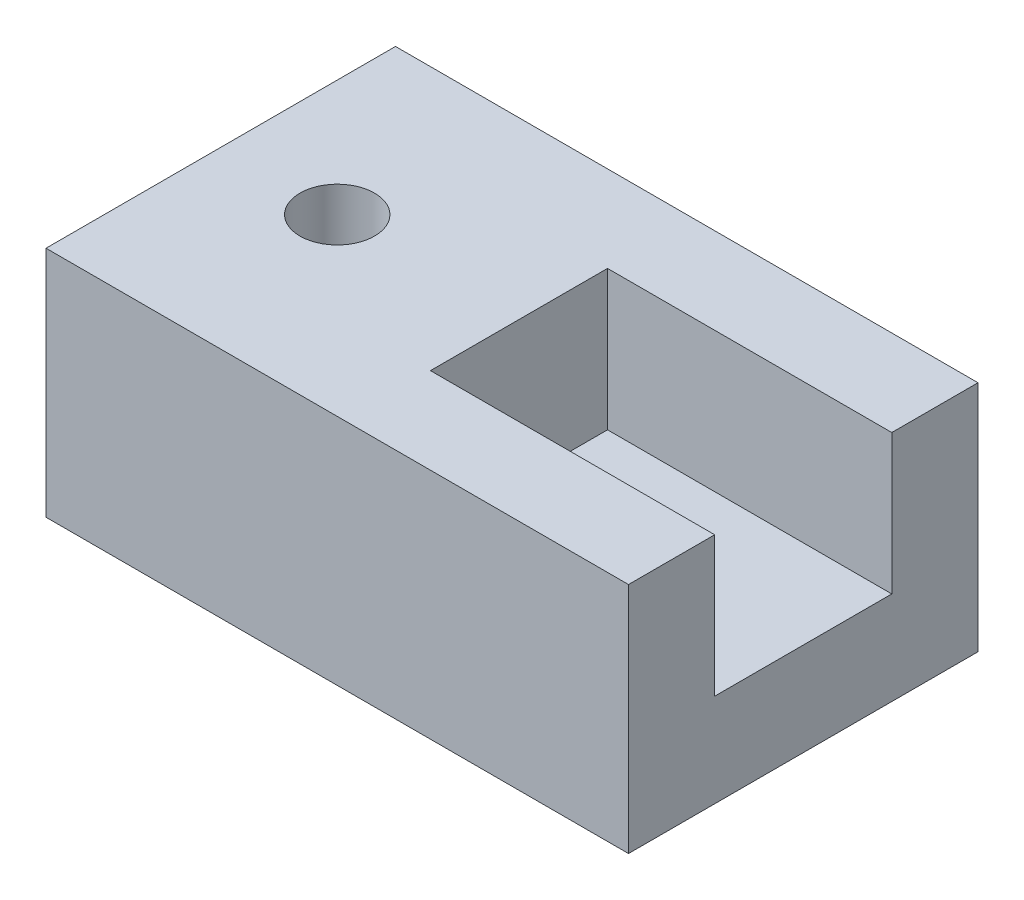
ISO-10303-21;
HEADER;
FILE_DESCRIPTION(('STEP AP214'),'2;1');
FILE_NAME('part.step','',(''),(''),'','','');
FILE_SCHEMA(('AUTOMOTIVE_DESIGN { 1 0 10303 214 1 1 1 1 }'));
ENDSEC;
DATA;
#1=APPLICATION_CONTEXT('core data for automotive mechanical design processes');
#2=APPLICATION_PROTOCOL_DEFINITION('international standard','automotive_design',2000,#1);
#3=PRODUCT_CONTEXT('',#1,'mechanical');
#4=PRODUCT('Part','Part','',(#3));
#5=PRODUCT_RELATED_PRODUCT_CATEGORY('part','',(#4));
#6=PRODUCT_DEFINITION_FORMATION('','',#4);
#7=PRODUCT_DEFINITION_CONTEXT('part definition',#1,'design');
#8=PRODUCT_DEFINITION('design','',#6,#7);
#9=PRODUCT_DEFINITION_SHAPE('','',#8);
#10=(LENGTH_UNIT() NAMED_UNIT(*) SI_UNIT(.MILLI.,.METRE.));
#11=(NAMED_UNIT(*) PLANE_ANGLE_UNIT() SI_UNIT($,.RADIAN.));
#12=(NAMED_UNIT(*) SI_UNIT($,.STERADIAN.) SOLID_ANGLE_UNIT());
#13=UNCERTAINTY_MEASURE_WITH_UNIT(LENGTH_MEASURE(1.E-05),#10,'distance_accuracy_value','');
#14=(GEOMETRIC_REPRESENTATION_CONTEXT(3) GLOBAL_UNCERTAINTY_ASSIGNED_CONTEXT((#13)) GLOBAL_UNIT_ASSIGNED_CONTEXT((#10,
#11,#12)) REPRESENTATION_CONTEXT('',''));
#15=CARTESIAN_POINT('',(0.,0.,0.));
#16=DIRECTION('',(0.,0.,1.));
#17=DIRECTION('',(1.,0.,0.));
#18=AXIS2_PLACEMENT_3D('',#15,#16,#17);
#19=CARTESIAN_POINT('',(25.,8.,-7.59999999999999));
#20=DIRECTION('',(0.,0.,-1.));
#21=DIRECTION('',(-1.,0.,0.));
#22=AXIS2_PLACEMENT_3D('',#19,#20,#21);
#23=PLANE('',#22);
#24=DIRECTION('',(0.,-1.,0.));
#25=VECTOR('',#24,1.);
#26=CARTESIAN_POINT('',(0.599999999999998,49.7724705054854,-7.60000000000002));
#27=LINE('',#26,#25);
#28=CARTESIAN_POINT('',(0.6,20.,-7.59999999999999));
#29=VERTEX_POINT('',#28);
#30=CARTESIAN_POINT('',(0.600000000000003,8.,-7.59999999999999));
#31=VERTEX_POINT('',#30);
#32=EDGE_CURVE('E109',#29,#31,#27,.T.);
#33=ORIENTED_EDGE('',*,*,#32,.T.);
#34=DIRECTION('',(-1.,0.,0.));
#35=VECTOR('',#34,1.);
#36=CARTESIAN_POINT('',(25.,8.,-7.59999999999999));
#37=LINE('',#36,#35);
#38=CARTESIAN_POINT('',(25.,8.,-7.59999999999999));
#39=VERTEX_POINT('',#38);
#40=EDGE_CURVE('E105',#39,#31,#37,.T.);
#41=ORIENTED_EDGE('',*,*,#40,.F.);
#42=DIRECTION('',(0.,-1.,0.));
#43=VECTOR('',#42,1.);
#44=CARTESIAN_POINT('',(25.,8.,-7.59999999999999));
#45=LINE('',#44,#43);
#46=CARTESIAN_POINT('',(25.,20.,-7.59999999999999));
#47=VERTEX_POINT('',#46);
#48=EDGE_CURVE('E108',#47,#39,#45,.T.);
#49=ORIENTED_EDGE('',*,*,#48,.F.);
#50=DIRECTION('',(-1.,0.,0.));
#51=VECTOR('',#50,1.);
#52=CARTESIAN_POINT('',(25.,20.,-7.59999999999999));
#53=LINE('',#52,#51);
#54=EDGE_CURVE('E56',#47,#29,#53,.T.);
#55=ORIENTED_EDGE('',*,*,#54,.T.);
#56=EDGE_LOOP('',(#33,#41,#49,#55));
#57=FACE_BOUND('',#56,.T.);
#58=ADVANCED_FACE('F41',(#57),#23,.F.);
#59=CARTESIAN_POINT('',(25.,8.,7.60000000000001));
#60=DIRECTION('',(0.,0.,1.));
#61=DIRECTION('',(0.,-1.,0.));
#62=AXIS2_PLACEMENT_3D('',#59,#60,#61);
#63=PLANE('',#62);
#64=DIRECTION('',(0.,-1.,0.));
#65=VECTOR('',#64,1.);
#66=CARTESIAN_POINT('',(0.6,49.7724705054855,7.6));
#67=LINE('',#66,#65);
#68=CARTESIAN_POINT('',(0.6,20.,7.60000000000001));
#69=VERTEX_POINT('',#68);
#70=CARTESIAN_POINT('',(0.6,8.,7.60000000000001));
#71=VERTEX_POINT('',#70);
#72=EDGE_CURVE('E64',#69,#71,#67,.T.);
#73=ORIENTED_EDGE('',*,*,#72,.F.);
#74=DIRECTION('',(-1.,0.,0.));
#75=VECTOR('',#74,1.);
#76=CARTESIAN_POINT('',(25.,20.,7.60000000000001));
#77=LINE('',#76,#75);
#78=CARTESIAN_POINT('',(25.,20.,7.60000000000001));
#79=VERTEX_POINT('',#78);
#80=EDGE_CURVE('E136',#79,#69,#77,.T.);
#81=ORIENTED_EDGE('',*,*,#80,.F.);
#82=DIRECTION('',(0.,1.,0.));
#83=VECTOR('',#82,1.);
#84=CARTESIAN_POINT('',(25.,8.,7.60000000000001));
#85=LINE('',#84,#83);
#86=CARTESIAN_POINT('',(25.,8.,7.60000000000001));
#87=VERTEX_POINT('',#86);
#88=EDGE_CURVE('E113',#87,#79,#85,.T.);
#89=ORIENTED_EDGE('',*,*,#88,.F.);
#90=DIRECTION('',(-1.,0.,0.));
#91=VECTOR('',#90,1.);
#92=CARTESIAN_POINT('',(25.,8.,7.60000000000001));
#93=LINE('',#92,#91);
#94=EDGE_CURVE('E112',#87,#71,#93,.T.);
#95=ORIENTED_EDGE('',*,*,#94,.T.);
#96=EDGE_LOOP('',(#73,#81,#89,#95));
#97=FACE_BOUND('',#96,.T.);
#98=ADVANCED_FACE('F189',(#97),#63,.F.);
#99=CARTESIAN_POINT('',(25.,8.,7.60000000000001));
#100=DIRECTION('',(0.,-1.,0.));
#101=DIRECTION('',(0.,0.,-1.));
#102=AXIS2_PLACEMENT_3D('',#99,#100,#101);
#103=PLANE('',#102);
#104=CARTESIAN_POINT('',(11.,8.,0.));
#105=DIRECTION('',(0.,1.,0.));
#106=DIRECTION('',(0.,0.,1.));
#107=AXIS2_PLACEMENT_3D('',#104,#105,#106);
#108=CIRCLE('',#107,4.2);
#109=CARTESIAN_POINT('',(11.,8.,4.2));
#110=VERTEX_POINT('',#109);
#111=EDGE_CURVE('E129',#110,#110,#108,.T.);
#112=ORIENTED_EDGE('',*,*,#111,.F.);
#113=EDGE_LOOP('',(#112));
#114=FACE_BOUND('',#113,.T.);
#115=DIRECTION('',(0.,0.,-1.));
#116=VECTOR('',#115,1.);
#117=CARTESIAN_POINT('',(0.599999999999998,8.,-7.60000000000001));
#118=LINE('',#117,#116);
#119=EDGE_CURVE('E295',#71,#31,#118,.T.);
#120=ORIENTED_EDGE('',*,*,#119,.F.);
#121=ORIENTED_EDGE('',*,*,#94,.F.);
#122=DIRECTION('',(0.,0.,1.));
#123=VECTOR('',#122,1.);
#124=CARTESIAN_POINT('',(25.,8.,7.60000000000001));
#125=LINE('',#124,#123);
#126=EDGE_CURVE('E116',#39,#87,#125,.T.);
#127=ORIENTED_EDGE('',*,*,#126,.F.);
#128=ORIENTED_EDGE('',*,*,#40,.T.);
#129=EDGE_LOOP('',(#120,#121,#127,#128));
#130=FACE_BOUND('',#129,.T.);
#131=ADVANCED_FACE('F117',(#114,#130),#103,.F.);
#132=CARTESIAN_POINT('',(-25.,20.,15.));
#133=DIRECTION('',(1.,0.,0.));
#134=DIRECTION('',(0.,0.,-1.));
#135=AXIS2_PLACEMENT_3D('',#132,#133,#134);
#136=PLANE('',#135);
#137=DIRECTION('',(0.,-1.,0.));
#138=VECTOR('',#137,1.);
#139=CARTESIAN_POINT('',(-25.,20.,15.));
#140=LINE('',#139,#138);
#141=CARTESIAN_POINT('',(-25.,20.,15.));
#142=VERTEX_POINT('',#141);
#143=CARTESIAN_POINT('',(-25.,0.,15.));
#144=VERTEX_POINT('',#143);
#145=EDGE_CURVE('E11',#142,#144,#140,.T.);
#146=ORIENTED_EDGE('',*,*,#145,.F.);
#147=DIRECTION('',(0.,0.,1.));
#148=VECTOR('',#147,1.);
#149=CARTESIAN_POINT('',(-25.,20.,15.));
#150=LINE('',#149,#148);
#151=CARTESIAN_POINT('',(-25.,20.,-15.));
#152=VERTEX_POINT('',#151);
#153=EDGE_CURVE('E139',#152,#142,#150,.T.);
#154=ORIENTED_EDGE('',*,*,#153,.F.);
#155=DIRECTION('',(0.,-1.,0.));
#156=VECTOR('',#155,1.);
#157=CARTESIAN_POINT('',(-25.,20.,-15.));
#158=LINE('',#157,#156);
#159=CARTESIAN_POINT('',(-25.,0.,-15.));
#160=VERTEX_POINT('',#159);
#161=EDGE_CURVE('E149',#152,#160,#158,.T.);
#162=ORIENTED_EDGE('',*,*,#161,.T.);
#163=DIRECTION('',(0.,0.,1.));
#164=VECTOR('',#163,1.);
#165=CARTESIAN_POINT('',(-25.,0.,15.));
#166=LINE('',#165,#164);
#167=EDGE_CURVE('E135',#160,#144,#166,.T.);
#168=ORIENTED_EDGE('',*,*,#167,.T.);
#169=EDGE_LOOP('',(#146,#154,#162,#168));
#170=FACE_BOUND('',#169,.T.);
#171=ADVANCED_FACE('F43',(#170),#136,.F.);
#172=CARTESIAN_POINT('',(25.,20.,15.));
#173=DIRECTION('',(0.,0.,-1.));
#174=DIRECTION('',(-1.,0.,0.));
#175=AXIS2_PLACEMENT_3D('',#172,#173,#174);
#176=PLANE('',#175);
#177=DIRECTION('',(1.,0.,0.));
#178=VECTOR('',#177,1.);
#179=CARTESIAN_POINT('',(25.,0.,15.));
#180=LINE('',#179,#178);
#181=CARTESIAN_POINT('',(25.,0.,15.));
#182=VERTEX_POINT('',#181);
#183=EDGE_CURVE('E152',#144,#182,#180,.T.);
#184=ORIENTED_EDGE('',*,*,#183,.T.);
#185=DIRECTION('',(0.,-1.,0.));
#186=VECTOR('',#185,1.);
#187=CARTESIAN_POINT('',(25.,20.,15.));
#188=LINE('',#187,#186);
#189=CARTESIAN_POINT('',(25.,20.,15.));
#190=VERTEX_POINT('',#189);
#191=EDGE_CURVE('E49',#190,#182,#188,.T.);
#192=ORIENTED_EDGE('',*,*,#191,.F.);
#193=DIRECTION('',(1.,0.,0.));
#194=VECTOR('',#193,1.);
#195=CARTESIAN_POINT('',(25.,20.,15.));
#196=LINE('',#195,#194);
#197=EDGE_CURVE('E141',#142,#190,#196,.T.);
#198=ORIENTED_EDGE('',*,*,#197,.F.);
#199=ORIENTED_EDGE('',*,*,#145,.T.);
#200=EDGE_LOOP('',(#184,#192,#198,#199));
#201=FACE_BOUND('',#200,.T.);
#202=ADVANCED_FACE('F181',(#201),#176,.F.);
#203=CARTESIAN_POINT('',(25.,20.,15.));
#204=DIRECTION('',(-1.,0.,0.));
#205=DIRECTION('',(0.,0.,1.));
#206=AXIS2_PLACEMENT_3D('',#203,#204,#205);
#207=PLANE('',#206);
#208=DIRECTION('',(0.,0.,-1.));
#209=VECTOR('',#208,1.);
#210=CARTESIAN_POINT('',(25.,20.,15.));
#211=LINE('',#210,#209);
#212=CARTESIAN_POINT('',(25.,20.,-15.));
#213=VERTEX_POINT('',#212);
#214=EDGE_CURVE('E125',#47,#213,#211,.T.);
#215=ORIENTED_EDGE('',*,*,#214,.F.);
#216=ORIENTED_EDGE('',*,*,#48,.T.);
#217=ORIENTED_EDGE('',*,*,#126,.T.);
#218=ORIENTED_EDGE('',*,*,#88,.T.);
#219=EDGE_CURVE('E144',#190,#79,#211,.T.);
#220=ORIENTED_EDGE('',*,*,#219,.F.);
#221=ORIENTED_EDGE('',*,*,#191,.T.);
#222=DIRECTION('',(0.,0.,-1.));
#223=VECTOR('',#222,1.);
#224=CARTESIAN_POINT('',(25.,0.,15.));
#225=LINE('',#224,#223);
#226=CARTESIAN_POINT('',(25.,0.,-15.));
#227=VERTEX_POINT('',#226);
#228=EDGE_CURVE('E154',#182,#227,#225,.T.);
#229=ORIENTED_EDGE('',*,*,#228,.T.);
#230=DIRECTION('',(0.,-1.,0.));
#231=VECTOR('',#230,1.);
#232=CARTESIAN_POINT('',(25.,20.,-15.));
#233=LINE('',#232,#231);
#234=EDGE_CURVE('E159',#213,#227,#233,.T.);
#235=ORIENTED_EDGE('',*,*,#234,.F.);
#236=EDGE_LOOP('',(#215,#216,#217,#218,#220,#221,#229,#235));
#237=FACE_BOUND('',#236,.T.);
#238=ADVANCED_FACE('F123',(#237),#207,.F.);
#239=CARTESIAN_POINT('',(25.,20.,-15.));
#240=DIRECTION('',(0.,0.,1.));
#241=DIRECTION('',(1.,0.,0.));
#242=AXIS2_PLACEMENT_3D('',#239,#240,#241);
#243=PLANE('',#242);
#244=DIRECTION('',(-1.,0.,0.));
#245=VECTOR('',#244,1.);
#246=CARTESIAN_POINT('',(25.,0.,-15.));
#247=LINE('',#246,#245);
#248=EDGE_CURVE('E142',#227,#160,#247,.T.);
#249=ORIENTED_EDGE('',*,*,#248,.T.);
#250=ORIENTED_EDGE('',*,*,#161,.F.);
#251=DIRECTION('',(-1.,0.,0.));
#252=VECTOR('',#251,1.);
#253=CARTESIAN_POINT('',(25.,20.,-15.));
#254=LINE('',#253,#252);
#255=EDGE_CURVE('E147',#213,#152,#254,.T.);
#256=ORIENTED_EDGE('',*,*,#255,.F.);
#257=ORIENTED_EDGE('',*,*,#234,.T.);
#258=EDGE_LOOP('',(#249,#250,#256,#257));
#259=FACE_BOUND('',#258,.T.);
#260=ADVANCED_FACE('F173',(#259),#243,.F.);
#261=CARTESIAN_POINT('',(0.,20.,0.));
#262=DIRECTION('',(0.,1.,0.));
#263=DIRECTION('',(0.,0.,1.));
#264=AXIS2_PLACEMENT_3D('',#261,#262,#263);
#265=PLANE('',#264);
#266=ORIENTED_EDGE('',*,*,#80,.T.);
#267=DIRECTION('',(0.,0.,-1.));
#268=VECTOR('',#267,1.);
#269=CARTESIAN_POINT('',(0.599999999999998,20.,-7.60000000000002));
#270=LINE('',#269,#268);
#271=EDGE_CURVE('E294',#69,#29,#270,.T.);
#272=ORIENTED_EDGE('',*,*,#271,.T.);
#273=ORIENTED_EDGE('',*,*,#54,.F.);
#274=ORIENTED_EDGE('',*,*,#214,.T.);
#275=ORIENTED_EDGE('',*,*,#255,.T.);
#276=ORIENTED_EDGE('',*,*,#153,.T.);
#277=ORIENTED_EDGE('',*,*,#197,.T.);
#278=ORIENTED_EDGE('',*,*,#219,.T.);
#279=EDGE_LOOP('',(#266,#272,#273,#274,#275,#276,#277,#278));
#280=FACE_BOUND('',#279,.T.);
#281=CARTESIAN_POINT('',(-15.,20.,0.));
#282=DIRECTION('',(0.,1.,0.));
#283=DIRECTION('',(0.,0.,1.));
#284=AXIS2_PLACEMENT_3D('',#281,#282,#283);
#285=CIRCLE('',#284,3.2);
#286=CARTESIAN_POINT('',(-15.,20.,3.2));
#287=VERTEX_POINT('',#286);
#288=EDGE_CURVE('E296',#287,#287,#285,.T.);
#289=ORIENTED_EDGE('',*,*,#288,.F.);
#290=EDGE_LOOP('',(#289));
#291=FACE_BOUND('',#290,.T.);
#292=ADVANCED_FACE('F179',(#280,#291),#265,.T.);
#293=CARTESIAN_POINT('',(0.,0.,0.));
#294=DIRECTION('',(0.,1.,0.));
#295=DIRECTION('',(0.,0.,1.));
#296=AXIS2_PLACEMENT_3D('',#293,#294,#295);
#297=PLANE('',#296);
#298=CARTESIAN_POINT('',(-15.,0.,0.));
#299=DIRECTION('',(0.,1.,0.));
#300=DIRECTION('',(0.,0.,1.));
#301=AXIS2_PLACEMENT_3D('',#298,#299,#300);
#302=CIRCLE('',#301,3.2);
#303=CARTESIAN_POINT('',(-15.,0.,3.2));
#304=VERTEX_POINT('',#303);
#305=EDGE_CURVE('E303',#304,#304,#302,.T.);
#306=ORIENTED_EDGE('',*,*,#305,.T.);
#307=EDGE_LOOP('',(#306));
#308=FACE_BOUND('',#307,.T.);
#309=CARTESIAN_POINT('',(11.,0.,0.));
#310=DIRECTION('',(0.,1.,0.));
#311=DIRECTION('',(0.,0.,1.));
#312=AXIS2_PLACEMENT_3D('',#309,#310,#311);
#313=CIRCLE('',#312,4.2);
#314=CARTESIAN_POINT('',(11.,0.,4.2));
#315=VERTEX_POINT('',#314);
#316=EDGE_CURVE('E126',#315,#315,#313,.T.);
#317=ORIENTED_EDGE('',*,*,#316,.T.);
#318=EDGE_LOOP('',(#317));
#319=FACE_BOUND('',#318,.T.);
#320=ORIENTED_EDGE('',*,*,#167,.F.);
#321=ORIENTED_EDGE('',*,*,#248,.F.);
#322=ORIENTED_EDGE('',*,*,#228,.F.);
#323=ORIENTED_EDGE('',*,*,#183,.F.);
#324=EDGE_LOOP('',(#320,#321,#322,#323));
#325=FACE_BOUND('',#324,.T.);
#326=ADVANCED_FACE('F170',(#308,#319,#325),#297,.F.);
#327=CARTESIAN_POINT('',(11.,0.,0.));
#328=DIRECTION('',(0.,1.,0.));
#329=DIRECTION('',(0.,0.,1.));
#330=AXIS2_PLACEMENT_3D('',#327,#328,#329);
#331=CYLINDRICAL_SURFACE('',#330,4.2);
#332=ORIENTED_EDGE('',*,*,#316,.F.);
#333=EDGE_LOOP('',(#332));
#334=FACE_BOUND('',#333,.T.);
#335=ORIENTED_EDGE('',*,*,#111,.T.);
#336=EDGE_LOOP('',(#335));
#337=FACE_BOUND('',#336,.T.);
#338=ADVANCED_FACE('F202',(#334,#337),#331,.F.);
#339=CARTESIAN_POINT('',(-15.,0.,0.));
#340=DIRECTION('',(0.,1.,0.));
#341=DIRECTION('',(0.,0.,1.));
#342=AXIS2_PLACEMENT_3D('',#339,#340,#341);
#343=CYLINDRICAL_SURFACE('',#342,3.2);
#344=ORIENTED_EDGE('',*,*,#305,.F.);
#345=EDGE_LOOP('',(#344));
#346=FACE_BOUND('',#345,.T.);
#347=ORIENTED_EDGE('',*,*,#288,.T.);
#348=EDGE_LOOP('',(#347));
#349=FACE_BOUND('',#348,.T.);
#350=ADVANCED_FACE('F222',(#346,#349),#343,.F.);
#351=CARTESIAN_POINT('',(0.599999999999998,49.7724705054854,-7.60000000000002));
#352=DIRECTION('',(-1.,0.,0.));
#353=DIRECTION('',(0.,0.,1.));
#354=AXIS2_PLACEMENT_3D('',#351,#352,#353);
#355=PLANE('',#354);
#356=ORIENTED_EDGE('',*,*,#271,.F.);
#357=ORIENTED_EDGE('',*,*,#72,.T.);
#358=ORIENTED_EDGE('',*,*,#119,.T.);
#359=ORIENTED_EDGE('',*,*,#32,.F.);
#360=EDGE_LOOP('',(#356,#357,#358,#359));
#361=FACE_BOUND('',#360,.T.);
#362=ADVANCED_FACE('F254',(#361),#355,.F.);
#363=CLOSED_SHELL('',(#58,#98,#131,#171,#202,#238,#260,#292,#326,#338,#350,#362));
#364=MANIFOLD_SOLID_BREP('B2',#363);
#365=ADVANCED_BREP_SHAPE_REPRESENTATION('',(#18,#364),#14);
#366=SHAPE_DEFINITION_REPRESENTATION(#9,#365);
ENDSEC;
END-ISO-10303-21;
